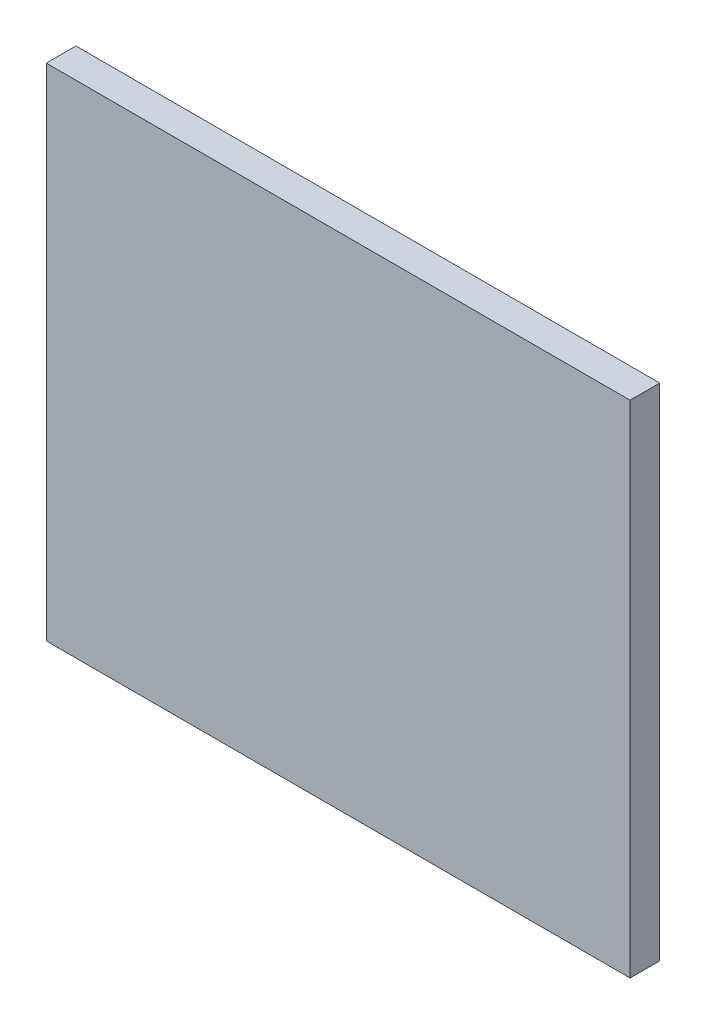
ISO-10303-21;
HEADER;
FILE_DESCRIPTION(('STEP AP214'),'2;1');
FILE_NAME('part.step','',(''),(''),'','','');
FILE_SCHEMA(('AUTOMOTIVE_DESIGN { 1 0 10303 214 1 1 1 1 }'));
ENDSEC;
DATA;
#1=APPLICATION_CONTEXT('core data for automotive mechanical design processes');
#2=APPLICATION_PROTOCOL_DEFINITION('international standard','automotive_design',2000,#1);
#3=PRODUCT_CONTEXT('',#1,'mechanical');
#4=PRODUCT('Part','Part','',(#3));
#5=PRODUCT_RELATED_PRODUCT_CATEGORY('part','',(#4));
#6=PRODUCT_DEFINITION_FORMATION('','',#4);
#7=PRODUCT_DEFINITION_CONTEXT('part definition',#1,'design');
#8=PRODUCT_DEFINITION('design','',#6,#7);
#9=PRODUCT_DEFINITION_SHAPE('','',#8);
#10=(LENGTH_UNIT() NAMED_UNIT(*) SI_UNIT(.MILLI.,.METRE.));
#11=(NAMED_UNIT(*) PLANE_ANGLE_UNIT() SI_UNIT($,.RADIAN.));
#12=(NAMED_UNIT(*) SI_UNIT($,.STERADIAN.) SOLID_ANGLE_UNIT());
#13=UNCERTAINTY_MEASURE_WITH_UNIT(LENGTH_MEASURE(1.E-05),#10,'distance_accuracy_value','');
#14=(GEOMETRIC_REPRESENTATION_CONTEXT(3) GLOBAL_UNCERTAINTY_ASSIGNED_CONTEXT((#13)) GLOBAL_UNIT_ASSIGNED_CONTEXT((#10,
#11,#12)) REPRESENTATION_CONTEXT('',''));
#15=CARTESIAN_POINT('',(0.,0.,0.));
#16=DIRECTION('',(0.,0.,1.));
#17=DIRECTION('',(1.,0.,0.));
#18=AXIS2_PLACEMENT_3D('',#15,#16,#17);
#19=CARTESIAN_POINT('',(95.6169967651367,85.9869995117188,0.));
#20=DIRECTION('',(0.,-1.,0.));
#21=DIRECTION('',(-1.,0.,0.));
#22=AXIS2_PLACEMENT_3D('',#19,#20,#21);
#23=PLANE('',#22);
#24=DIRECTION('',(-1.,0.,0.));
#25=VECTOR('',#24,1.);
#26=CARTESIAN_POINT('',(95.6169967651367,85.9869995117188,0.03556));
#27=LINE('',#26,#25);
#28=CARTESIAN_POINT('',(95.6169967651367,85.9869995117188,0.03556));
#29=VERTEX_POINT('',#28);
#30=CARTESIAN_POINT('',(94.9169998168945,85.9869995117188,0.03556));
#31=VERTEX_POINT('',#30);
#32=EDGE_CURVE('E11',#29,#31,#27,.T.);
#33=ORIENTED_EDGE('',*,*,#32,.F.);
#34=DIRECTION('',(0.,0.,1.));
#35=VECTOR('',#34,1.);
#36=CARTESIAN_POINT('',(95.6169967651367,85.9869995117188,0.));
#37=LINE('',#36,#35);
#38=CARTESIAN_POINT('',(95.6169967651367,85.9869995117188,0.));
#39=VERTEX_POINT('',#38);
#40=EDGE_CURVE('E24',#39,#29,#37,.T.);
#41=ORIENTED_EDGE('',*,*,#40,.F.);
#42=DIRECTION('',(-1.,0.,0.));
#43=VECTOR('',#42,1.);
#44=CARTESIAN_POINT('',(95.6169967651367,85.9869995117188,0.));
#45=LINE('',#44,#43);
#46=CARTESIAN_POINT('',(94.9169998168945,85.9869995117188,0.));
#47=VERTEX_POINT('',#46);
#48=EDGE_CURVE('E75',#39,#47,#45,.T.);
#49=ORIENTED_EDGE('',*,*,#48,.T.);
#50=DIRECTION('',(0.,0.,1.));
#51=VECTOR('',#50,1.);
#52=CARTESIAN_POINT('',(94.9169998168945,85.9869995117188,0.));
#53=LINE('',#52,#51);
#54=EDGE_CURVE('E37',#47,#31,#53,.T.);
#55=ORIENTED_EDGE('',*,*,#54,.T.);
#56=EDGE_LOOP('',(#33,#41,#49,#55));
#57=FACE_BOUND('',#56,.T.);
#58=ADVANCED_FACE('F17',(#57),#23,.F.);
#59=CARTESIAN_POINT('',(94.9169998168945,85.9869995117188,0.));
#60=DIRECTION('',(1.,0.,0.));
#61=DIRECTION('',(0.,-1.,0.));
#62=AXIS2_PLACEMENT_3D('',#59,#60,#61);
#63=PLANE('',#62);
#64=DIRECTION('',(0.,-1.,0.));
#65=VECTOR('',#64,1.);
#66=CARTESIAN_POINT('',(94.9169998168945,85.9869995117188,0.03556));
#67=LINE('',#66,#65);
#68=CARTESIAN_POINT('',(94.9169998168945,85.3870010375977,0.03556));
#69=VERTEX_POINT('',#68);
#70=EDGE_CURVE('E83',#31,#69,#67,.T.);
#71=ORIENTED_EDGE('',*,*,#70,.F.);
#72=ORIENTED_EDGE('',*,*,#54,.F.);
#73=DIRECTION('',(0.,-1.,0.));
#74=VECTOR('',#73,1.);
#75=CARTESIAN_POINT('',(94.9169998168945,85.9869995117188,0.));
#76=LINE('',#75,#74);
#77=CARTESIAN_POINT('',(94.9169998168945,85.3870010375977,0.));
#78=VERTEX_POINT('',#77);
#79=EDGE_CURVE('E81',#47,#78,#76,.T.);
#80=ORIENTED_EDGE('',*,*,#79,.T.);
#81=DIRECTION('',(0.,0.,1.));
#82=VECTOR('',#81,1.);
#83=CARTESIAN_POINT('',(94.9169998168945,85.3870010375977,0.));
#84=LINE('',#83,#82);
#85=EDGE_CURVE('E67',#78,#69,#84,.T.);
#86=ORIENTED_EDGE('',*,*,#85,.T.);
#87=EDGE_LOOP('',(#71,#72,#80,#86));
#88=FACE_BOUND('',#87,.T.);
#89=ADVANCED_FACE('F89',(#88),#63,.F.);
#90=CARTESIAN_POINT('',(94.9169998168945,85.3870010375977,0.));
#91=DIRECTION('',(0.,1.,0.));
#92=DIRECTION('',(1.,0.,0.));
#93=AXIS2_PLACEMENT_3D('',#90,#91,#92);
#94=PLANE('',#93);
#95=DIRECTION('',(1.,0.,0.));
#96=VECTOR('',#95,1.);
#97=CARTESIAN_POINT('',(94.9169998168945,85.3870010375977,0.03556));
#98=LINE('',#97,#96);
#99=CARTESIAN_POINT('',(95.6169967651367,85.3870010375977,0.03556));
#100=VERTEX_POINT('',#99);
#101=EDGE_CURVE('E71',#69,#100,#98,.T.);
#102=ORIENTED_EDGE('',*,*,#101,.F.);
#103=ORIENTED_EDGE('',*,*,#85,.F.);
#104=DIRECTION('',(1.,0.,0.));
#105=VECTOR('',#104,1.);
#106=CARTESIAN_POINT('',(94.9169998168945,85.3870010375977,0.));
#107=LINE('',#106,#105);
#108=CARTESIAN_POINT('',(95.6169967651367,85.3870010375977,0.));
#109=VERTEX_POINT('',#108);
#110=EDGE_CURVE('E63',#78,#109,#107,.T.);
#111=ORIENTED_EDGE('',*,*,#110,.T.);
#112=DIRECTION('',(0.,0.,1.));
#113=VECTOR('',#112,1.);
#114=CARTESIAN_POINT('',(95.6169967651367,85.3870010375977,0.));
#115=LINE('',#114,#113);
#116=EDGE_CURVE('E53',#109,#100,#115,.T.);
#117=ORIENTED_EDGE('',*,*,#116,.T.);
#118=EDGE_LOOP('',(#102,#103,#111,#117));
#119=FACE_BOUND('',#118,.T.);
#120=ADVANCED_FACE('F66',(#119),#94,.F.);
#121=CARTESIAN_POINT('',(95.6169967651367,85.3870010375977,0.));
#122=DIRECTION('',(-1.,0.,0.));
#123=DIRECTION('',(0.,1.,0.));
#124=AXIS2_PLACEMENT_3D('',#121,#122,#123);
#125=PLANE('',#124);
#126=DIRECTION('',(0.,1.,0.));
#127=VECTOR('',#126,1.);
#128=CARTESIAN_POINT('',(95.6169967651367,85.3870010375977,0.03556));
#129=LINE('',#128,#127);
#130=EDGE_CURVE('E59',#100,#29,#129,.T.);
#131=ORIENTED_EDGE('',*,*,#130,.F.);
#132=ORIENTED_EDGE('',*,*,#116,.F.);
#133=DIRECTION('',(0.,1.,0.));
#134=VECTOR('',#133,1.);
#135=CARTESIAN_POINT('',(95.6169967651367,85.3870010375977,0.));
#136=LINE('',#135,#134);
#137=EDGE_CURVE('E57',#109,#39,#136,.T.);
#138=ORIENTED_EDGE('',*,*,#137,.T.);
#139=ORIENTED_EDGE('',*,*,#40,.T.);
#140=EDGE_LOOP('',(#131,#132,#138,#139));
#141=FACE_BOUND('',#140,.T.);
#142=ADVANCED_FACE('F55',(#141),#125,.F.);
#143=CARTESIAN_POINT('',(95.6169967651367,85.9869995117188,0.));
#144=DIRECTION('',(0.,0.,-1.));
#145=DIRECTION('',(-1.,0.,0.));
#146=AXIS2_PLACEMENT_3D('',#143,#144,#145);
#147=PLANE('',#146);
#148=ORIENTED_EDGE('',*,*,#137,.F.);
#149=ORIENTED_EDGE('',*,*,#110,.F.);
#150=ORIENTED_EDGE('',*,*,#79,.F.);
#151=ORIENTED_EDGE('',*,*,#48,.F.);
#152=EDGE_LOOP('',(#148,#149,#150,#151));
#153=FACE_BOUND('',#152,.T.);
#154=ADVANCED_FACE('F74',(#153),#147,.T.);
#155=CARTESIAN_POINT('',(95.6169967651367,85.9869995117188,0.03556));
#156=DIRECTION('',(0.,0.,-1.));
#157=DIRECTION('',(-1.,0.,0.));
#158=AXIS2_PLACEMENT_3D('',#155,#156,#157);
#159=PLANE('',#158);
#160=ORIENTED_EDGE('',*,*,#32,.T.);
#161=ORIENTED_EDGE('',*,*,#70,.T.);
#162=ORIENTED_EDGE('',*,*,#101,.T.);
#163=ORIENTED_EDGE('',*,*,#130,.T.);
#164=EDGE_LOOP('',(#160,#161,#162,#163));
#165=FACE_BOUND('',#164,.T.);
#166=ADVANCED_FACE('F91',(#165),#159,.F.);
#167=CLOSED_SHELL('',(#58,#89,#120,#142,#154,#166));
#168=MANIFOLD_SOLID_BREP('B1',#167);
#169=ADVANCED_BREP_SHAPE_REPRESENTATION('',(#18,#168),#14);
#170=SHAPE_DEFINITION_REPRESENTATION(#9,#169);
ENDSEC;
END-ISO-10303-21;
